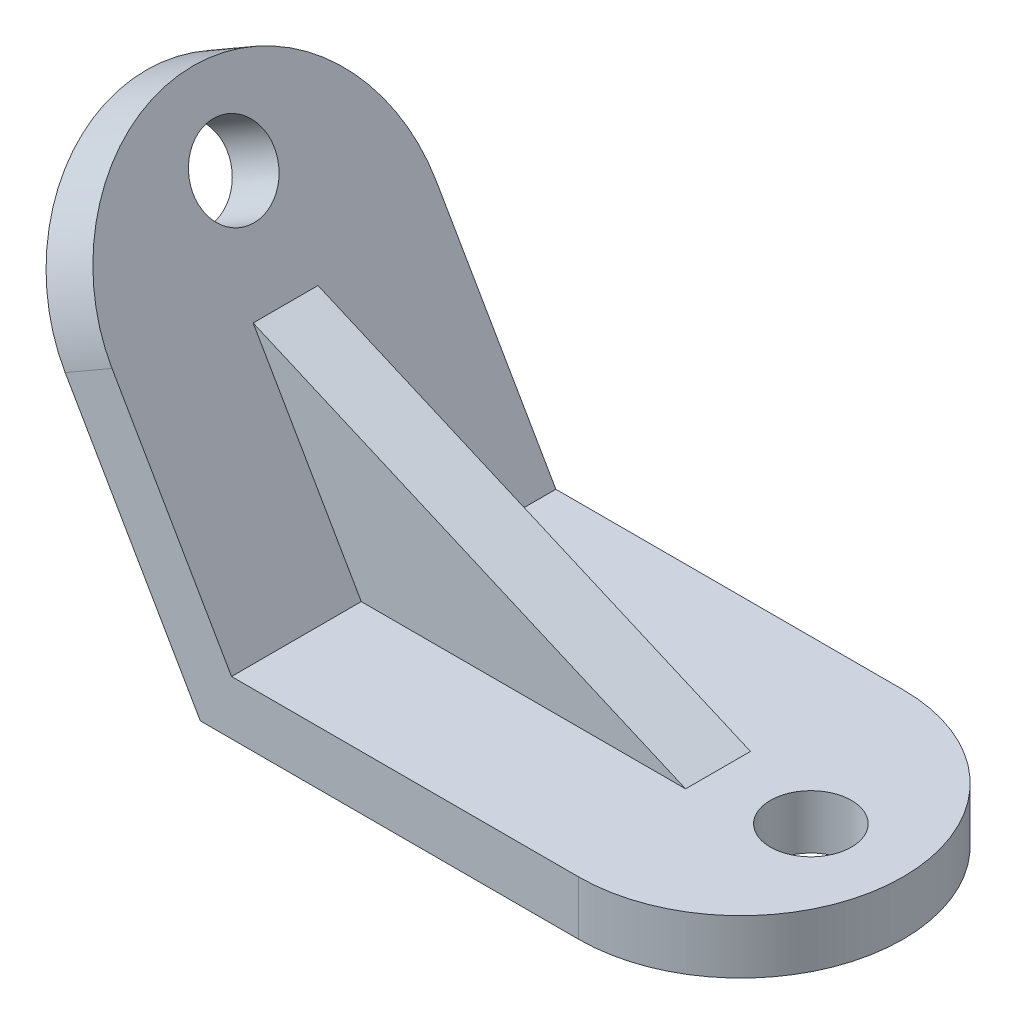
ISO-10303-21;
HEADER;
FILE_DESCRIPTION(('STEP AP214'),'2;1');
FILE_NAME('part.step','',(''),(''),'','','');
FILE_SCHEMA(('AUTOMOTIVE_DESIGN { 1 0 10303 214 1 1 1 1 }'));
ENDSEC;
DATA;
#1=APPLICATION_CONTEXT('core data for automotive mechanical design processes');
#2=APPLICATION_PROTOCOL_DEFINITION('international standard','automotive_design',2000,#1);
#3=PRODUCT_CONTEXT('',#1,'mechanical');
#4=PRODUCT('Part','Part','',(#3));
#5=PRODUCT_RELATED_PRODUCT_CATEGORY('part','',(#4));
#6=PRODUCT_DEFINITION_FORMATION('','',#4);
#7=PRODUCT_DEFINITION_CONTEXT('part definition',#1,'design');
#8=PRODUCT_DEFINITION('design','',#6,#7);
#9=PRODUCT_DEFINITION_SHAPE('','',#8);
#10=(LENGTH_UNIT() NAMED_UNIT(*) SI_UNIT(.MILLI.,.METRE.));
#11=(NAMED_UNIT(*) PLANE_ANGLE_UNIT() SI_UNIT($,.RADIAN.));
#12=(NAMED_UNIT(*) SI_UNIT($,.STERADIAN.) SOLID_ANGLE_UNIT());
#13=UNCERTAINTY_MEASURE_WITH_UNIT(LENGTH_MEASURE(1.E-05),#10,'distance_accuracy_value','');
#14=(GEOMETRIC_REPRESENTATION_CONTEXT(3) GLOBAL_UNCERTAINTY_ASSIGNED_CONTEXT((#13)) GLOBAL_UNIT_ASSIGNED_CONTEXT((#10,
#11,#12)) REPRESENTATION_CONTEXT('',''));
#15=CARTESIAN_POINT('',(0.,0.,0.));
#16=DIRECTION('',(0.,0.,1.));
#17=DIRECTION('',(1.,0.,0.));
#18=AXIS2_PLACEMENT_3D('',#15,#16,#17);
#19=CARTESIAN_POINT('',(5.77350269189627,10.,30.));
#20=DIRECTION('',(-0.86602540378444,-0.499999999999998,0.));
#21=DIRECTION('',(0.499999999999998,-0.86602540378444,0.));
#22=AXIS2_PLACEMENT_3D('',#19,#20,#21);
#23=PLANE('',#22);
#24=CARTESIAN_POINT('',(-23.8160681094295,61.250640002053,0.));
#25=DIRECTION('',(-0.86602540378444,-0.499999999999998,0.));
#26=DIRECTION('',(0.499999999999998,-0.86602540378444,0.));
#27=AXIS2_PLACEMENT_3D('',#24,#25,#26);
#28=CIRCLE('',#27,7.5);
#29=CARTESIAN_POINT('',(-20.0660681094295,54.7554494736697,0.));
#30=VERTEX_POINT('',#29);
#31=EDGE_CURVE('E215',#30,#30,#28,.T.);
#32=ORIENTED_EDGE('',*,*,#31,.T.);
#33=EDGE_LOOP('',(#32));
#34=FACE_BOUND('',#33,.T.);
#35=DIRECTION('',(0.5,-0.866025403784439,0.));
#36=VECTOR('',#35,1.);
#37=CARTESIAN_POINT('',(5.77350269189627,10.,6.));
#38=LINE('',#37,#36);
#39=CARTESIAN_POINT('',(-14.2264973081037,44.6410161513775,6.));
#40=VERTEX_POINT('',#39);
#41=CARTESIAN_POINT('',(5.77350269189627,10.,6.));
#42=VERTEX_POINT('',#41);
#43=EDGE_CURVE('E121',#40,#42,#38,.T.);
#44=ORIENTED_EDGE('',*,*,#43,.F.);
#45=DIRECTION('',(0.,0.,-1.));
#46=VECTOR('',#45,1.);
#47=CARTESIAN_POINT('',(-14.2264973081037,44.6410161513775,6.));
#48=LINE('',#47,#46);
#49=CARTESIAN_POINT('',(-14.2264973081037,44.6410161513775,-6.));
#50=VERTEX_POINT('',#49);
#51=EDGE_CURVE('E203',#40,#50,#48,.T.);
#52=ORIENTED_EDGE('',*,*,#51,.T.);
#53=DIRECTION('',(0.5,-0.866025403784439,0.));
#54=VECTOR('',#53,1.);
#55=CARTESIAN_POINT('',(5.77350269189627,10.,-6.));
#56=LINE('',#55,#54);
#57=CARTESIAN_POINT('',(5.77350269189627,10.,-6.));
#58=VERTEX_POINT('',#57);
#59=EDGE_CURVE('E208',#50,#58,#56,.T.);
#60=ORIENTED_EDGE('',*,*,#59,.T.);
#61=DIRECTION('',(0.,0.,-1.));
#62=VECTOR('',#61,1.);
#63=CARTESIAN_POINT('',(5.77350269189627,10.,30.));
#64=LINE('',#63,#62);
#65=CARTESIAN_POINT('',(5.77350269189627,10.,-30.));
#66=VERTEX_POINT('',#65);
#67=EDGE_CURVE('E145',#58,#66,#64,.T.);
#68=ORIENTED_EDGE('',*,*,#67,.T.);
#69=DIRECTION('',(-0.499999999999998,0.86602540378444,0.));
#70=VECTOR('',#69,1.);
#71=CARTESIAN_POINT('',(5.77350269189627,10.,-30.));
#72=LINE('',#71,#70);
#73=CARTESIAN_POINT('',(-16.3397459621555,48.301270189222,-30.));
#74=VERTEX_POINT('',#73);
#75=EDGE_CURVE('E177',#66,#74,#72,.T.);
#76=ORIENTED_EDGE('',*,*,#75,.T.);
#77=CARTESIAN_POINT('',(-16.3397459621555,48.301270189222,0.));
#78=DIRECTION('',(0.86602540378444,0.499999999999998,0.));
#79=DIRECTION('',(-0.499999999999998,0.86602540378444,0.));
#80=AXIS2_PLACEMENT_3D('',#77,#78,#79);
#81=CIRCLE('',#80,30.);
#82=CARTESIAN_POINT('',(-16.3397459621555,48.301270189222,30.));
#83=VERTEX_POINT('',#82);
#84=EDGE_CURVE('E196',#74,#83,#81,.T.);
#85=ORIENTED_EDGE('',*,*,#84,.T.);
#86=DIRECTION('',(-0.499999999999998,0.86602540378444,0.));
#87=VECTOR('',#86,1.);
#88=CARTESIAN_POINT('',(5.77350269189627,10.,30.));
#89=LINE('',#88,#87);
#90=CARTESIAN_POINT('',(5.77350269189627,10.,30.));
#91=VERTEX_POINT('',#90);
#92=EDGE_CURVE('E143',#91,#83,#89,.T.);
#93=ORIENTED_EDGE('',*,*,#92,.F.);
#94=EDGE_CURVE('E136',#91,#42,#64,.T.);
#95=ORIENTED_EDGE('',*,*,#94,.T.);
#96=EDGE_LOOP('',(#44,#52,#60,#68,#76,#85,#93,#95));
#97=FACE_BOUND('',#96,.T.);
#98=ADVANCED_FACE('F51',(#34,#97),#23,.F.);
#99=CARTESIAN_POINT('',(100.,10.,30.));
#100=DIRECTION('',(0.,-1.,0.));
#101=DIRECTION('',(0.,0.,-1.));
#102=AXIS2_PLACEMENT_3D('',#99,#100,#101);
#103=PLANE('',#102);
#104=CARTESIAN_POINT('',(82.9515300029904,10.,0.));
#105=DIRECTION('',(0.,1.,0.));
#106=DIRECTION('',(0.,0.,1.));
#107=AXIS2_PLACEMENT_3D('',#104,#105,#106);
#108=CIRCLE('',#107,7.5);
#109=CARTESIAN_POINT('',(82.9515300029904,10.,7.5));
#110=VERTEX_POINT('',#109);
#111=EDGE_CURVE('E212',#110,#110,#108,.T.);
#112=ORIENTED_EDGE('',*,*,#111,.F.);
#113=EDGE_LOOP('',(#112));
#114=FACE_BOUND('',#113,.T.);
#115=DIRECTION('',(1.,0.,0.));
#116=VECTOR('',#115,1.);
#117=CARTESIAN_POINT('',(5.77350269189627,10.,6.));
#118=LINE('',#117,#116);
#119=CARTESIAN_POINT('',(65.7735026918963,10.,6.));
#120=VERTEX_POINT('',#119);
#121=EDGE_CURVE('E124',#42,#120,#118,.T.);
#122=ORIENTED_EDGE('',*,*,#121,.F.);
#123=ORIENTED_EDGE('',*,*,#94,.F.);
#124=DIRECTION('',(-1.,0.,0.));
#125=VECTOR('',#124,1.);
#126=CARTESIAN_POINT('',(100.,10.,30.));
#127=LINE('',#126,#125);
#128=CARTESIAN_POINT('',(70.,10.,30.));
#129=VERTEX_POINT('',#128);
#130=EDGE_CURVE('E157',#129,#91,#127,.T.);
#131=ORIENTED_EDGE('',*,*,#130,.F.);
#132=CARTESIAN_POINT('',(70.,10.,0.));
#133=DIRECTION('',(0.,1.,0.));
#134=DIRECTION('',(0.,0.,1.));
#135=AXIS2_PLACEMENT_3D('',#132,#133,#134);
#136=CIRCLE('',#135,30.);
#137=CARTESIAN_POINT('',(70.,10.,-30.));
#138=VERTEX_POINT('',#137);
#139=EDGE_CURVE('E162',#129,#138,#136,.T.);
#140=ORIENTED_EDGE('',*,*,#139,.T.);
#141=DIRECTION('',(-1.,0.,0.));
#142=VECTOR('',#141,1.);
#143=CARTESIAN_POINT('',(100.,10.,-30.));
#144=LINE('',#143,#142);
#145=EDGE_CURVE('E175',#138,#66,#144,.T.);
#146=ORIENTED_EDGE('',*,*,#145,.T.);
#147=ORIENTED_EDGE('',*,*,#67,.F.);
#148=DIRECTION('',(1.,0.,0.));
#149=VECTOR('',#148,1.);
#150=CARTESIAN_POINT('',(5.77350269189627,10.,-6.));
#151=LINE('',#150,#149);
#152=CARTESIAN_POINT('',(65.7735026918963,10.,-6.));
#153=VERTEX_POINT('',#152);
#154=EDGE_CURVE('E206',#58,#153,#151,.T.);
#155=ORIENTED_EDGE('',*,*,#154,.T.);
#156=DIRECTION('',(0.,0.,-1.));
#157=VECTOR('',#156,1.);
#158=CARTESIAN_POINT('',(65.7735026918963,10.,6.));
#159=LINE('',#158,#157);
#160=EDGE_CURVE('E139',#120,#153,#159,.T.);
#161=ORIENTED_EDGE('',*,*,#160,.F.);
#162=EDGE_LOOP('',(#122,#123,#131,#140,#146,#147,#155,#161));
#163=FACE_BOUND('',#162,.T.);
#164=ADVANCED_FACE('F53',(#114,#163),#103,.F.);
#165=CARTESIAN_POINT('',(0.,0.,30.));
#166=DIRECTION('',(0.86602540378444,0.499999999999998,0.));
#167=DIRECTION('',(-0.499999999999998,0.86602540378444,0.));
#168=AXIS2_PLACEMENT_3D('',#165,#166,#167);
#169=PLANE('',#168);
#170=CARTESIAN_POINT('',(-32.4763221472739,56.250640002053,0.));
#171=DIRECTION('',(-0.86602540378444,-0.499999999999998,0.));
#172=DIRECTION('',(0.499999999999998,-0.86602540378444,0.));
#173=AXIS2_PLACEMENT_3D('',#170,#171,#172);
#174=CIRCLE('',#173,7.5);
#175=CARTESIAN_POINT('',(-28.7263221472739,49.7554494736697,0.));
#176=VERTEX_POINT('',#175);
#177=EDGE_CURVE('E218',#176,#176,#174,.T.);
#178=ORIENTED_EDGE('',*,*,#177,.F.);
#179=EDGE_LOOP('',(#178));
#180=FACE_BOUND('',#179,.T.);
#181=CARTESIAN_POINT('',(-24.9999999999999,43.301270189222,0.));
#182=DIRECTION('',(0.86602540378444,0.499999999999998,0.));
#183=DIRECTION('',(-0.499999999999998,0.86602540378444,0.));
#184=AXIS2_PLACEMENT_3D('',#181,#182,#183);
#185=CIRCLE('',#184,30.);
#186=CARTESIAN_POINT('',(-24.9999999999999,43.301270189222,-30.));
#187=VERTEX_POINT('',#186);
#188=CARTESIAN_POINT('',(-24.9999999999999,43.301270189222,30.));
#189=VERTEX_POINT('',#188);
#190=EDGE_CURVE('E12',#187,#189,#185,.T.);
#191=ORIENTED_EDGE('',*,*,#190,.F.);
#192=DIRECTION('',(0.499999999999998,-0.86602540378444,0.));
#193=VECTOR('',#192,1.);
#194=CARTESIAN_POINT('',(0.,0.,-30.));
#195=LINE('',#194,#193);
#196=CARTESIAN_POINT('',(0.,0.,-30.));
#197=VERTEX_POINT('',#196);
#198=EDGE_CURVE('E169',#187,#197,#195,.T.);
#199=ORIENTED_EDGE('',*,*,#198,.T.);
#200=DIRECTION('',(0.,0.,-1.));
#201=VECTOR('',#200,1.);
#202=CARTESIAN_POINT('',(0.,0.,30.));
#203=LINE('',#202,#201);
#204=CARTESIAN_POINT('',(0.,0.,30.));
#205=VERTEX_POINT('',#204);
#206=EDGE_CURVE('E148',#205,#197,#203,.T.);
#207=ORIENTED_EDGE('',*,*,#206,.F.);
#208=DIRECTION('',(0.499999999999998,-0.86602540378444,0.));
#209=VECTOR('',#208,1.);
#210=CARTESIAN_POINT('',(0.,0.,30.));
#211=LINE('',#210,#209);
#212=EDGE_CURVE('E166',#189,#205,#211,.T.);
#213=ORIENTED_EDGE('',*,*,#212,.F.);
#214=EDGE_LOOP('',(#191,#199,#207,#213));
#215=FACE_BOUND('',#214,.T.);
#216=ADVANCED_FACE('F184',(#180,#215),#169,.F.);
#217=CARTESIAN_POINT('',(100.,0.,30.));
#218=DIRECTION('',(0.,1.,0.));
#219=DIRECTION('',(0.,0.,1.));
#220=AXIS2_PLACEMENT_3D('',#217,#218,#219);
#221=PLANE('',#220);
#222=CARTESIAN_POINT('',(82.9515300029904,0.,0.));
#223=DIRECTION('',(0.,1.,0.));
#224=DIRECTION('',(0.,0.,1.));
#225=AXIS2_PLACEMENT_3D('',#222,#223,#224);
#226=CIRCLE('',#225,7.5);
#227=CARTESIAN_POINT('',(82.9515300029904,0.,7.5));
#228=VERTEX_POINT('',#227);
#229=EDGE_CURVE('E55',#228,#228,#226,.T.);
#230=ORIENTED_EDGE('',*,*,#229,.T.);
#231=EDGE_LOOP('',(#230));
#232=FACE_BOUND('',#231,.T.);
#233=CARTESIAN_POINT('',(70.,0.,0.));
#234=DIRECTION('',(0.,1.,0.));
#235=DIRECTION('',(0.,0.,1.));
#236=AXIS2_PLACEMENT_3D('',#233,#234,#235);
#237=CIRCLE('',#236,30.);
#238=CARTESIAN_POINT('',(70.,0.,30.));
#239=VERTEX_POINT('',#238);
#240=CARTESIAN_POINT('',(70.,0.,-30.));
#241=VERTEX_POINT('',#240);
#242=EDGE_CURVE('E75',#239,#241,#237,.T.);
#243=ORIENTED_EDGE('',*,*,#242,.F.);
#244=DIRECTION('',(1.,0.,0.));
#245=VECTOR('',#244,1.);
#246=CARTESIAN_POINT('',(100.,0.,30.));
#247=LINE('',#246,#245);
#248=EDGE_CURVE('E159',#205,#239,#247,.T.);
#249=ORIENTED_EDGE('',*,*,#248,.F.);
#250=ORIENTED_EDGE('',*,*,#206,.T.);
#251=DIRECTION('',(1.,0.,0.));
#252=VECTOR('',#251,1.);
#253=CARTESIAN_POINT('',(100.,0.,-30.));
#254=LINE('',#253,#252);
#255=EDGE_CURVE('E164',#197,#241,#254,.T.);
#256=ORIENTED_EDGE('',*,*,#255,.T.);
#257=EDGE_LOOP('',(#243,#249,#250,#256));
#258=FACE_BOUND('',#257,.T.);
#259=ADVANCED_FACE('F191',(#232,#258),#221,.F.);
#260=CARTESIAN_POINT('',(0.,0.,30.));
#261=DIRECTION('',(0.,0.,1.));
#262=DIRECTION('',(1.,0.,0.));
#263=AXIS2_PLACEMENT_3D('',#260,#261,#262);
#264=PLANE('',#263);
#265=DIRECTION('',(0.86602540378444,0.499999999999998,0.));
#266=VECTOR('',#265,1.);
#267=CARTESIAN_POINT('',(-68.3012701892219,18.3012701892221,30.));
#268=LINE('',#267,#266);
#269=EDGE_CURVE('E195',#189,#83,#268,.T.);
#270=ORIENTED_EDGE('',*,*,#269,.F.);
#271=ORIENTED_EDGE('',*,*,#212,.T.);
#272=ORIENTED_EDGE('',*,*,#248,.T.);
#273=DIRECTION('',(0.,1.,0.));
#274=VECTOR('',#273,1.);
#275=CARTESIAN_POINT('',(70.,-50.,30.));
#276=LINE('',#275,#274);
#277=EDGE_CURVE('E60',#239,#129,#276,.T.);
#278=ORIENTED_EDGE('',*,*,#277,.T.);
#279=ORIENTED_EDGE('',*,*,#130,.T.);
#280=ORIENTED_EDGE('',*,*,#92,.T.);
#281=EDGE_LOOP('',(#270,#271,#272,#278,#279,#280));
#282=FACE_BOUND('',#281,.T.);
#283=ADVANCED_FACE('F156',(#282),#264,.T.);
#284=CARTESIAN_POINT('',(0.,0.,-30.));
#285=DIRECTION('',(0.,0.,1.));
#286=DIRECTION('',(1.,0.,0.));
#287=AXIS2_PLACEMENT_3D('',#284,#285,#286);
#288=PLANE('',#287);
#289=ORIENTED_EDGE('',*,*,#198,.F.);
#290=DIRECTION('',(0.86602540378444,0.499999999999998,0.));
#291=VECTOR('',#290,1.);
#292=CARTESIAN_POINT('',(-68.3012701892219,18.3012701892221,-30.));
#293=LINE('',#292,#291);
#294=EDGE_CURVE('E200',#187,#74,#293,.T.);
#295=ORIENTED_EDGE('',*,*,#294,.T.);
#296=ORIENTED_EDGE('',*,*,#75,.F.);
#297=ORIENTED_EDGE('',*,*,#145,.F.);
#298=DIRECTION('',(0.,1.,0.));
#299=VECTOR('',#298,1.);
#300=CARTESIAN_POINT('',(70.,-50.,-30.));
#301=LINE('',#300,#299);
#302=EDGE_CURVE('E144',#241,#138,#301,.T.);
#303=ORIENTED_EDGE('',*,*,#302,.F.);
#304=ORIENTED_EDGE('',*,*,#255,.F.);
#305=EDGE_LOOP('',(#289,#295,#296,#297,#303,#304));
#306=FACE_BOUND('',#305,.T.);
#307=ADVANCED_FACE('F192',(#306),#288,.F.);
#308=CARTESIAN_POINT('',(70.,-50.,0.));
#309=DIRECTION('',(0.,1.,0.));
#310=DIRECTION('',(0.,0.,1.));
#311=AXIS2_PLACEMENT_3D('',#308,#309,#310);
#312=CYLINDRICAL_SURFACE('',#311,30.);
#313=ORIENTED_EDGE('',*,*,#242,.T.);
#314=ORIENTED_EDGE('',*,*,#302,.T.);
#315=ORIENTED_EDGE('',*,*,#139,.F.);
#316=ORIENTED_EDGE('',*,*,#277,.F.);
#317=EDGE_LOOP('',(#313,#314,#315,#316));
#318=FACE_BOUND('',#317,.T.);
#319=ADVANCED_FACE('F194',(#318),#312,.T.);
#320=CARTESIAN_POINT('',(-68.3012701892219,18.3012701892221,0.));
#321=DIRECTION('',(0.86602540378444,0.499999999999998,0.));
#322=DIRECTION('',(-0.499999999999998,0.86602540378444,0.));
#323=AXIS2_PLACEMENT_3D('',#320,#321,#322);
#324=CYLINDRICAL_SURFACE('',#323,30.);
#325=ORIENTED_EDGE('',*,*,#190,.T.);
#326=ORIENTED_EDGE('',*,*,#269,.T.);
#327=ORIENTED_EDGE('',*,*,#84,.F.);
#328=ORIENTED_EDGE('',*,*,#294,.F.);
#329=EDGE_LOOP('',(#325,#326,#327,#328));
#330=FACE_BOUND('',#329,.T.);
#331=ADVANCED_FACE('F256',(#330),#324,.T.);
#332=CARTESIAN_POINT('',(-14.2264973081037,44.6410161513775,6.));
#333=DIRECTION('',(-0.397359707119513,-0.917662935482247,0.));
#334=DIRECTION('',(0.917662935482247,-0.397359707119513,0.));
#335=AXIS2_PLACEMENT_3D('',#332,#333,#334);
#336=PLANE('',#335);
#337=DIRECTION('',(-0.917662935482247,0.397359707119513,0.));
#338=VECTOR('',#337,1.);
#339=CARTESIAN_POINT('',(-14.2264973081037,44.6410161513775,-6.));
#340=LINE('',#339,#338);
#341=EDGE_CURVE('E67',#153,#50,#340,.T.);
#342=ORIENTED_EDGE('',*,*,#341,.T.);
#343=ORIENTED_EDGE('',*,*,#51,.F.);
#344=DIRECTION('',(-0.917662935482247,0.397359707119513,0.));
#345=VECTOR('',#344,1.);
#346=CARTESIAN_POINT('',(-14.2264973081037,44.6410161513775,6.));
#347=LINE('',#346,#345);
#348=EDGE_CURVE('E126',#120,#40,#347,.T.);
#349=ORIENTED_EDGE('',*,*,#348,.F.);
#350=ORIENTED_EDGE('',*,*,#160,.T.);
#351=EDGE_LOOP('',(#342,#343,#349,#350));
#352=FACE_BOUND('',#351,.T.);
#353=ADVANCED_FACE('F251',(#352),#336,.F.);
#354=CARTESIAN_POINT('',(0.,0.,6.));
#355=DIRECTION('',(0.,0.,-1.));
#356=DIRECTION('',(-1.,0.,0.));
#357=AXIS2_PLACEMENT_3D('',#354,#355,#356);
#358=PLANE('',#357);
#359=ORIENTED_EDGE('',*,*,#43,.T.);
#360=ORIENTED_EDGE('',*,*,#121,.T.);
#361=ORIENTED_EDGE('',*,*,#348,.T.);
#362=EDGE_LOOP('',(#359,#360,#361));
#363=FACE_BOUND('',#362,.T.);
#364=ADVANCED_FACE('F123',(#363),#358,.F.);
#365=CARTESIAN_POINT('',(0.,0.,-6.));
#366=DIRECTION('',(0.,0.,-1.));
#367=DIRECTION('',(-1.,0.,0.));
#368=AXIS2_PLACEMENT_3D('',#365,#366,#367);
#369=PLANE('',#368);
#370=ORIENTED_EDGE('',*,*,#59,.F.);
#371=ORIENTED_EDGE('',*,*,#341,.F.);
#372=ORIENTED_EDGE('',*,*,#154,.F.);
#373=EDGE_LOOP('',(#370,#371,#372));
#374=FACE_BOUND('',#373,.T.);
#375=ADVANCED_FACE('F245',(#374),#369,.T.);
#376=CARTESIAN_POINT('',(82.9515300029904,-2.,0.));
#377=DIRECTION('',(0.,1.,0.));
#378=DIRECTION('',(0.,0.,1.));
#379=AXIS2_PLACEMENT_3D('',#376,#377,#378);
#380=CYLINDRICAL_SURFACE('',#379,7.5);
#381=ORIENTED_EDGE('',*,*,#111,.T.);
#382=EDGE_LOOP('',(#381));
#383=FACE_BOUND('',#382,.T.);
#384=ORIENTED_EDGE('',*,*,#229,.F.);
#385=EDGE_LOOP('',(#384));
#386=FACE_BOUND('',#385,.T.);
#387=ADVANCED_FACE('F240',(#383,#386),#380,.F.);
#388=CARTESIAN_POINT('',(-22.0840173018606,62.250640002053,0.));
#389=DIRECTION('',(-0.86602540378444,-0.499999999999998,0.));
#390=DIRECTION('',(0.499999999999998,-0.86602540378444,0.));
#391=AXIS2_PLACEMENT_3D('',#388,#389,#390);
#392=CYLINDRICAL_SURFACE('',#391,7.5);
#393=ORIENTED_EDGE('',*,*,#177,.T.);
#394=EDGE_LOOP('',(#393));
#395=FACE_BOUND('',#394,.T.);
#396=ORIENTED_EDGE('',*,*,#31,.F.);
#397=EDGE_LOOP('',(#396));
#398=FACE_BOUND('',#397,.T.);
#399=ADVANCED_FACE('F222',(#395,#398),#392,.F.);
#400=CLOSED_SHELL('',(#98,#164,#216,#259,#283,#307,#319,#331,#353,#364,#375,#387,#399));
#401=MANIFOLD_SOLID_BREP('B2',#400);
#402=ADVANCED_BREP_SHAPE_REPRESENTATION('',(#18,#401),#14);
#403=SHAPE_DEFINITION_REPRESENTATION(#9,#402);
ENDSEC;
END-ISO-10303-21;
